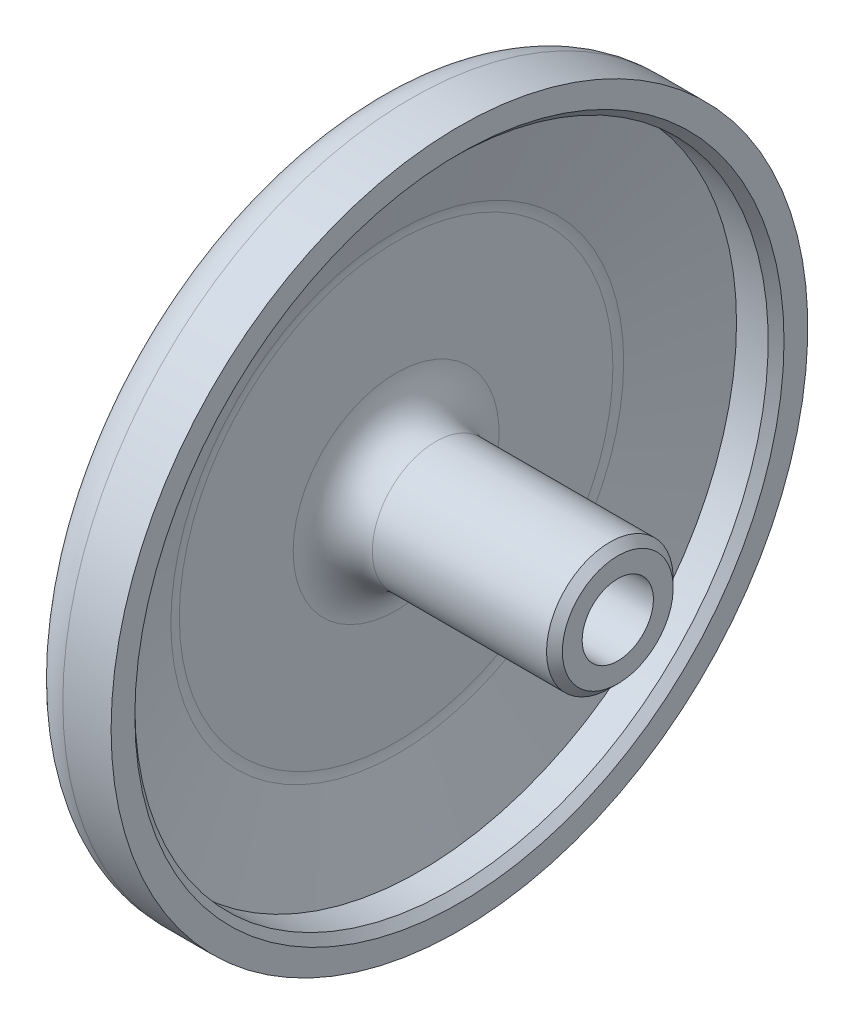
ISO-10303-21;
HEADER;
FILE_DESCRIPTION(('STEP AP214'),'2;1');
FILE_NAME('part.step','',(''),(''),'','','');
FILE_SCHEMA(('AUTOMOTIVE_DESIGN { 1 0 10303 214 1 1 1 1 }'));
ENDSEC;
DATA;
#1=APPLICATION_CONTEXT('core data for automotive mechanical design processes');
#2=APPLICATION_PROTOCOL_DEFINITION('international standard','automotive_design',2000,#1);
#3=PRODUCT_CONTEXT('',#1,'mechanical');
#4=PRODUCT('Part','Part','',(#3));
#5=PRODUCT_RELATED_PRODUCT_CATEGORY('part','',(#4));
#6=PRODUCT_DEFINITION_FORMATION('','',#4);
#7=PRODUCT_DEFINITION_CONTEXT('part definition',#1,'design');
#8=PRODUCT_DEFINITION('design','',#6,#7);
#9=PRODUCT_DEFINITION_SHAPE('','',#8);
#10=(LENGTH_UNIT() NAMED_UNIT(*) SI_UNIT(.MILLI.,.METRE.));
#11=(NAMED_UNIT(*) PLANE_ANGLE_UNIT() SI_UNIT($,.RADIAN.));
#12=(NAMED_UNIT(*) SI_UNIT($,.STERADIAN.) SOLID_ANGLE_UNIT());
#13=UNCERTAINTY_MEASURE_WITH_UNIT(LENGTH_MEASURE(1.E-05),#10,'distance_accuracy_value','');
#14=(GEOMETRIC_REPRESENTATION_CONTEXT(3) GLOBAL_UNCERTAINTY_ASSIGNED_CONTEXT((#13)) GLOBAL_UNIT_ASSIGNED_CONTEXT((#10,
#11,#12)) REPRESENTATION_CONTEXT('',''));
#15=CARTESIAN_POINT('',(0.,0.,0.));
#16=DIRECTION('',(0.,0.,1.));
#17=DIRECTION('',(1.,0.,0.));
#18=AXIS2_PLACEMENT_3D('',#15,#16,#17);
#19=CARTESIAN_POINT('',(0.,0.,0.));
#20=DIRECTION('',(-1.,0.,0.));
#21=DIRECTION('',(0.,0.,1.));
#22=AXIS2_PLACEMENT_3D('',#19,#20,#21);
#23=CYLINDRICAL_SURFACE('',#22,22.);
#24=CARTESIAN_POINT('',(0.951941016011039,0.,0.));
#25=DIRECTION('',(1.,0.,0.));
#26=DIRECTION('',(0.,0.,-1.));
#27=AXIS2_PLACEMENT_3D('',#24,#25,#26);
#28=CIRCLE('',#27,22.);
#29=CARTESIAN_POINT('',(0.951941016011039,0.,-22.));
#30=VERTEX_POINT('',#29);
#31=EDGE_CURVE('E67',#30,#30,#28,.T.);
#32=ORIENTED_EDGE('',*,*,#31,.T.);
#33=EDGE_LOOP('',(#32));
#34=FACE_BOUND('',#33,.T.);
#35=CARTESIAN_POINT('',(4.,0.,0.));
#36=DIRECTION('',(-1.,0.,0.));
#37=DIRECTION('',(0.,0.,1.));
#38=AXIS2_PLACEMENT_3D('',#35,#36,#37);
#39=CIRCLE('',#38,22.);
#40=CARTESIAN_POINT('',(4.,0.,22.));
#41=VERTEX_POINT('',#40);
#42=EDGE_CURVE('E79',#41,#41,#39,.T.);
#43=ORIENTED_EDGE('',*,*,#42,.T.);
#44=EDGE_LOOP('',(#43));
#45=FACE_BOUND('',#44,.T.);
#46=ADVANCED_FACE('F29',(#34,#45),#23,.T.);
#47=CARTESIAN_POINT('',(4.,22.,0.));
#48=DIRECTION('',(-1.,0.,0.));
#49=DIRECTION('',(0.,0.,1.));
#50=AXIS2_PLACEMENT_3D('',#47,#48,#49);
#51=PLANE('',#50);
#52=CARTESIAN_POINT('',(4.,0.,0.));
#53=DIRECTION('',(-1.,0.,0.));
#54=DIRECTION('',(0.,0.,1.));
#55=AXIS2_PLACEMENT_3D('',#52,#53,#54);
#56=CIRCLE('',#55,20.5);
#57=CARTESIAN_POINT('',(4.,0.,20.5));
#58=VERTEX_POINT('',#57);
#59=EDGE_CURVE('E52',#58,#58,#56,.T.);
#60=ORIENTED_EDGE('',*,*,#59,.T.);
#61=EDGE_LOOP('',(#60));
#62=FACE_BOUND('',#61,.T.);
#63=ORIENTED_EDGE('',*,*,#42,.F.);
#64=EDGE_LOOP('',(#63));
#65=FACE_BOUND('',#64,.T.);
#66=ADVANCED_FACE('F105',(#62,#65),#51,.F.);
#67=CARTESIAN_POINT('',(0.,0.,0.));
#68=DIRECTION('',(-1.,0.,0.));
#69=DIRECTION('',(0.,0.,1.));
#70=AXIS2_PLACEMENT_3D('',#67,#68,#69);
#71=CYLINDRICAL_SURFACE('',#70,20.);
#72=CARTESIAN_POINT('',(3.5,0.,0.));
#73=DIRECTION('',(-1.,0.,0.));
#74=DIRECTION('',(0.,0.,1.));
#75=AXIS2_PLACEMENT_3D('',#72,#73,#74);
#76=CIRCLE('',#75,20.);
#77=CARTESIAN_POINT('',(3.5,0.,20.));
#78=VERTEX_POINT('',#77);
#79=EDGE_CURVE('E49',#78,#78,#76,.F.);
#80=ORIENTED_EDGE('',*,*,#79,.T.);
#81=EDGE_LOOP('',(#80));
#82=FACE_BOUND('',#81,.T.);
#83=CARTESIAN_POINT('',(1.5,0.,0.));
#84=DIRECTION('',(-1.,0.,0.));
#85=DIRECTION('',(0.,0.,1.));
#86=AXIS2_PLACEMENT_3D('',#83,#84,#85);
#87=CIRCLE('',#86,20.);
#88=CARTESIAN_POINT('',(1.5,0.,20.));
#89=VERTEX_POINT('',#88);
#90=EDGE_CURVE('E82',#89,#89,#87,.T.);
#91=ORIENTED_EDGE('',*,*,#90,.T.);
#92=EDGE_LOOP('',(#91));
#93=FACE_BOUND('',#92,.T.);
#94=ADVANCED_FACE('F111',(#82,#93),#71,.F.);
#95=CARTESIAN_POINT('',(0.,0.,0.));
#96=DIRECTION('',(1.,0.,0.));
#97=DIRECTION('',(0.,0.,-1.));
#98=AXIS2_PLACEMENT_3D('',#95,#96,#97);
#99=CONICAL_SURFACE('',#98,14.,1.32581766366803);
#100=CARTESIAN_POINT('',(0.0746437496366645,0.,0.));
#101=DIRECTION('',(1.,0.,0.));
#102=DIRECTION('',(0.,0.,-1.));
#103=AXIS2_PLACEMENT_3D('',#100,#101,#102);
#104=CIRCLE('',#103,14.2985749985467);
#105=CARTESIAN_POINT('',(0.0746437496366645,0.,-14.2985749985467));
#106=VERTEX_POINT('',#105);
#107=EDGE_CURVE('E64',#106,#106,#104,.F.);
#108=ORIENTED_EDGE('',*,*,#107,.T.);
#109=EDGE_LOOP('',(#108));
#110=FACE_BOUND('',#109,.T.);
#111=ORIENTED_EDGE('',*,*,#90,.F.);
#112=EDGE_LOOP('',(#111));
#113=FACE_BOUND('',#112,.T.);
#114=ADVANCED_FACE('F146',(#110,#113),#99,.F.);
#115=CARTESIAN_POINT('',(0.,14.,0.));
#116=DIRECTION('',(-1.,0.,0.));
#117=DIRECTION('',(0.,0.,1.));
#118=AXIS2_PLACEMENT_3D('',#115,#116,#117);
#119=PLANE('',#118);
#120=CARTESIAN_POINT('',(0.,0.,0.));
#121=DIRECTION('',(-1.,0.,0.));
#122=DIRECTION('',(0.,0.,1.));
#123=AXIS2_PLACEMENT_3D('',#120,#121,#122);
#124=CIRCLE('',#123,13.6922359359559);
#125=CARTESIAN_POINT('',(0.,0.,13.6922359359559));
#126=VERTEX_POINT('',#125);
#127=EDGE_CURVE('E58',#126,#126,#124,.F.);
#128=ORIENTED_EDGE('',*,*,#127,.T.);
#129=EDGE_LOOP('',(#128));
#130=FACE_BOUND('',#129,.T.);
#131=CARTESIAN_POINT('',(0.,0.,0.));
#132=DIRECTION('',(-1.,0.,0.));
#133=DIRECTION('',(0.,0.,1.));
#134=AXIS2_PLACEMENT_3D('',#131,#132,#133);
#135=CIRCLE('',#134,6.5);
#136=CARTESIAN_POINT('',(0.,0.,6.5));
#137=VERTEX_POINT('',#136);
#138=EDGE_CURVE('E61',#137,#137,#135,.T.);
#139=ORIENTED_EDGE('',*,*,#138,.T.);
#140=EDGE_LOOP('',(#139));
#141=FACE_BOUND('',#140,.T.);
#142=ADVANCED_FACE('F150',(#130,#141),#119,.F.);
#143=CARTESIAN_POINT('',(0.,0.,0.));
#144=DIRECTION('',(-1.,0.,0.));
#145=DIRECTION('',(0.,0.,1.));
#146=AXIS2_PLACEMENT_3D('',#143,#144,#145);
#147=CYLINDRICAL_SURFACE('',#146,4.);
#148=CARTESIAN_POINT('',(13.5,0.,0.));
#149=DIRECTION('',(-1.,0.,0.));
#150=DIRECTION('',(0.,0.,1.));
#151=AXIS2_PLACEMENT_3D('',#148,#149,#150);
#152=CIRCLE('',#151,4.);
#153=CARTESIAN_POINT('',(13.5,0.,4.));
#154=VERTEX_POINT('',#153);
#155=EDGE_CURVE('E44',#154,#154,#152,.T.);
#156=ORIENTED_EDGE('',*,*,#155,.T.);
#157=EDGE_LOOP('',(#156));
#158=FACE_BOUND('',#157,.T.);
#159=CARTESIAN_POINT('',(2.5,0.,0.));
#160=DIRECTION('',(-1.,0.,0.));
#161=DIRECTION('',(0.,0.,1.));
#162=AXIS2_PLACEMENT_3D('',#159,#160,#161);
#163=CIRCLE('',#162,4.);
#164=CARTESIAN_POINT('',(2.5,0.,4.));
#165=VERTEX_POINT('',#164);
#166=EDGE_CURVE('E55',#165,#165,#163,.F.);
#167=ORIENTED_EDGE('',*,*,#166,.T.);
#168=EDGE_LOOP('',(#167));
#169=FACE_BOUND('',#168,.T.);
#170=ADVANCED_FACE('F156',(#158,#169),#147,.T.);
#171=CARTESIAN_POINT('',(14.,4.,0.));
#172=DIRECTION('',(-1.,0.,0.));
#173=DIRECTION('',(0.,0.,1.));
#174=AXIS2_PLACEMENT_3D('',#171,#172,#173);
#175=PLANE('',#174);
#176=CARTESIAN_POINT('',(14.,0.,0.));
#177=DIRECTION('',(-1.,0.,0.));
#178=DIRECTION('',(0.,0.,1.));
#179=AXIS2_PLACEMENT_3D('',#176,#177,#178);
#180=CIRCLE('',#179,2.25);
#181=CARTESIAN_POINT('',(14.,0.,2.25));
#182=VERTEX_POINT('',#181);
#183=EDGE_CURVE('E85',#182,#182,#180,.T.);
#184=ORIENTED_EDGE('',*,*,#183,.T.);
#185=EDGE_LOOP('',(#184));
#186=FACE_BOUND('',#185,.T.);
#187=CARTESIAN_POINT('',(14.,0.,0.));
#188=DIRECTION('',(-1.,0.,0.));
#189=DIRECTION('',(0.,0.,1.));
#190=AXIS2_PLACEMENT_3D('',#187,#188,#189);
#191=CIRCLE('',#190,3.5);
#192=CARTESIAN_POINT('',(14.,0.,3.5));
#193=VERTEX_POINT('',#192);
#194=EDGE_CURVE('E40',#193,#193,#191,.F.);
#195=ORIENTED_EDGE('',*,*,#194,.T.);
#196=EDGE_LOOP('',(#195));
#197=FACE_BOUND('',#196,.T.);
#198=ADVANCED_FACE('F89',(#186,#197),#175,.F.);
#199=CARTESIAN_POINT('',(-3.,0.,0.));
#200=DIRECTION('',(1.,0.,0.));
#201=DIRECTION('',(0.,0.,-1.));
#202=AXIS2_PLACEMENT_3D('',#199,#200,#201);
#203=PLANE('',#202);
#204=CARTESIAN_POINT('',(-3.,0.,0.));
#205=DIRECTION('',(1.,0.,0.));
#206=DIRECTION('',(0.,0.,-1.));
#207=AXIS2_PLACEMENT_3D('',#204,#205,#206);
#208=CIRCLE('',#207,3.25);
#209=CARTESIAN_POINT('',(-3.,0.,-3.25));
#210=VERTEX_POINT('',#209);
#211=EDGE_CURVE('E10',#210,#210,#208,.T.);
#212=ORIENTED_EDGE('',*,*,#211,.T.);
#213=EDGE_LOOP('',(#212));
#214=FACE_BOUND('',#213,.T.);
#215=CARTESIAN_POINT('',(-3.,0.,0.));
#216=DIRECTION('',(1.,0.,0.));
#217=DIRECTION('',(0.,0.,-1.));
#218=AXIS2_PLACEMENT_3D('',#215,#216,#217);
#219=CIRCLE('',#218,13.6922359359558);
#220=CARTESIAN_POINT('',(-3.,0.,-13.6922359359558));
#221=VERTEX_POINT('',#220);
#222=EDGE_CURVE('E76',#221,#221,#219,.F.);
#223=ORIENTED_EDGE('',*,*,#222,.T.);
#224=EDGE_LOOP('',(#223));
#225=FACE_BOUND('',#224,.T.);
#226=ADVANCED_FACE('F165',(#214,#225),#203,.F.);
#227=CARTESIAN_POINT('',(-1.,0.,0.));
#228=DIRECTION('',(1.,0.,0.));
#229=DIRECTION('',(0.,0.,-1.));
#230=AXIS2_PLACEMENT_3D('',#227,#228,#229);
#231=CONICAL_SURFACE('',#230,22.,1.32581766366803);
#232=CARTESIAN_POINT('',(-2.92535625036333,0.,0.));
#233=DIRECTION('',(-1.,0.,0.));
#234=DIRECTION('',(0.,0.,1.));
#235=AXIS2_PLACEMENT_3D('',#232,#233,#234);
#236=CIRCLE('',#235,14.2985749985467);
#237=CARTESIAN_POINT('',(-2.92535625036333,0.,14.2985749985467));
#238=VERTEX_POINT('',#237);
#239=EDGE_CURVE('E70',#238,#238,#236,.F.);
#240=ORIENTED_EDGE('',*,*,#239,.T.);
#241=EDGE_LOOP('',(#240));
#242=FACE_BOUND('',#241,.T.);
#243=CARTESIAN_POINT('',(-1.47341523435229,0.,0.));
#244=DIRECTION('',(-1.,0.,0.));
#245=DIRECTION('',(0.,0.,1.));
#246=AXIS2_PLACEMENT_3D('',#243,#244,#245);
#247=CIRCLE('',#246,20.1063390625908);
#248=CARTESIAN_POINT('',(-1.47341523435229,0.,20.1063390625908));
#249=VERTEX_POINT('',#248);
#250=EDGE_CURVE('E73',#249,#249,#247,.T.);
#251=ORIENTED_EDGE('',*,*,#250,.T.);
#252=EDGE_LOOP('',(#251));
#253=FACE_BOUND('',#252,.T.);
#254=ADVANCED_FACE('F121',(#242,#253),#231,.T.);
#255=CARTESIAN_POINT('',(-0.499999999999998,0.,0.));
#256=DIRECTION('',(1.,0.,0.));
#257=DIRECTION('',(0.,0.,-1.));
#258=AXIS2_PLACEMENT_3D('',#255,#256,#257);
#259=TOROIDAL_SURFACE('',#258,13.6922359359558,2.5);
#260=ORIENTED_EDGE('',*,*,#239,.F.);
#261=EDGE_LOOP('',(#260));
#262=FACE_BOUND('',#261,.T.);
#263=ORIENTED_EDGE('',*,*,#222,.F.);
#264=EDGE_LOOP('',(#263));
#265=FACE_BOUND('',#264,.T.);
#266=ADVANCED_FACE('F117',(#262,#265),#259,.T.);
#267=CARTESIAN_POINT('',(0.951941016011039,0.,0.));
#268=DIRECTION('',(1.,0.,0.));
#269=DIRECTION('',(0.,0.,-1.));
#270=AXIS2_PLACEMENT_3D('',#267,#268,#269);
#271=TOROIDAL_SURFACE('',#270,19.5,2.5);
#272=ORIENTED_EDGE('',*,*,#31,.F.);
#273=EDGE_LOOP('',(#272));
#274=FACE_BOUND('',#273,.T.);
#275=ORIENTED_EDGE('',*,*,#250,.F.);
#276=EDGE_LOOP('',(#275));
#277=FACE_BOUND('',#276,.T.);
#278=ADVANCED_FACE('F120',(#274,#277),#271,.T.);
#279=CARTESIAN_POINT('',(2.5,0.,0.));
#280=DIRECTION('',(-1.,0.,0.));
#281=DIRECTION('',(0.,0.,1.));
#282=AXIS2_PLACEMENT_3D('',#279,#280,#281);
#283=TOROIDAL_SURFACE('',#282,13.6922359359559,2.5);
#284=ORIENTED_EDGE('',*,*,#127,.F.);
#285=EDGE_LOOP('',(#284));
#286=FACE_BOUND('',#285,.T.);
#287=ORIENTED_EDGE('',*,*,#107,.F.);
#288=EDGE_LOOP('',(#287));
#289=FACE_BOUND('',#288,.T.);
#290=ADVANCED_FACE('F125',(#286,#289),#283,.F.);
#291=CARTESIAN_POINT('',(2.5,0.,0.));
#292=DIRECTION('',(-1.,0.,0.));
#293=DIRECTION('',(0.,0.,1.));
#294=AXIS2_PLACEMENT_3D('',#291,#292,#293);
#295=TOROIDAL_SURFACE('',#294,6.5,2.5);
#296=ORIENTED_EDGE('',*,*,#166,.F.);
#297=EDGE_LOOP('',(#296));
#298=FACE_BOUND('',#297,.T.);
#299=ORIENTED_EDGE('',*,*,#138,.F.);
#300=EDGE_LOOP('',(#299));
#301=FACE_BOUND('',#300,.T.);
#302=ADVANCED_FACE('F129',(#298,#301),#295,.F.);
#303=CARTESIAN_POINT('',(4.,0.,0.));
#304=DIRECTION('',(1.,0.,0.));
#305=DIRECTION('',(0.,0.,-1.));
#306=AXIS2_PLACEMENT_3D('',#303,#304,#305);
#307=CONICAL_SURFACE('',#306,20.5,0.785398163397445);
#308=ORIENTED_EDGE('',*,*,#79,.F.);
#309=EDGE_LOOP('',(#308));
#310=FACE_BOUND('',#309,.T.);
#311=ORIENTED_EDGE('',*,*,#59,.F.);
#312=EDGE_LOOP('',(#311));
#313=FACE_BOUND('',#312,.T.);
#314=ADVANCED_FACE('F101',(#310,#313),#307,.F.);
#315=CARTESIAN_POINT('',(13.5,0.,0.));
#316=DIRECTION('',(-1.,0.,0.));
#317=DIRECTION('',(0.,0.,1.));
#318=AXIS2_PLACEMENT_3D('',#315,#316,#317);
#319=CONICAL_SURFACE('',#318,4.,0.785398163397448);
#320=ORIENTED_EDGE('',*,*,#194,.F.);
#321=EDGE_LOOP('',(#320));
#322=FACE_BOUND('',#321,.T.);
#323=ORIENTED_EDGE('',*,*,#155,.F.);
#324=EDGE_LOOP('',(#323));
#325=FACE_BOUND('',#324,.T.);
#326=ADVANCED_FACE('F94',(#322,#325),#319,.T.);
#327=CARTESIAN_POINT('',(14.,0.,0.));
#328=DIRECTION('',(-1.,0.,0.));
#329=DIRECTION('',(0.,0.,1.));
#330=AXIS2_PLACEMENT_3D('',#327,#328,#329);
#331=CYLINDRICAL_SURFACE('',#330,2.25);
#332=CARTESIAN_POINT('',(-1.99999999999999,0.,0.));
#333=DIRECTION('',(1.,0.,0.));
#334=DIRECTION('',(0.,0.,-1.));
#335=AXIS2_PLACEMENT_3D('',#332,#333,#334);
#336=CIRCLE('',#335,2.25);
#337=CARTESIAN_POINT('',(-1.99999999999999,0.,-2.25));
#338=VERTEX_POINT('',#337);
#339=EDGE_CURVE('E36',#338,#338,#336,.F.);
#340=ORIENTED_EDGE('',*,*,#339,.T.);
#341=EDGE_LOOP('',(#340));
#342=FACE_BOUND('',#341,.T.);
#343=ORIENTED_EDGE('',*,*,#183,.F.);
#344=EDGE_LOOP('',(#343));
#345=FACE_BOUND('',#344,.T.);
#346=ADVANCED_FACE('F92',(#342,#345),#331,.F.);
#347=CARTESIAN_POINT('',(-1.99999999999999,0.,0.));
#348=DIRECTION('',(-1.,0.,0.));
#349=DIRECTION('',(0.,0.,1.));
#350=AXIS2_PLACEMENT_3D('',#347,#348,#349);
#351=CONICAL_SURFACE('',#350,2.25,0.785398163397448);
#352=ORIENTED_EDGE('',*,*,#211,.F.);
#353=EDGE_LOOP('',(#352));
#354=FACE_BOUND('',#353,.T.);
#355=ORIENTED_EDGE('',*,*,#339,.F.);
#356=EDGE_LOOP('',(#355));
#357=FACE_BOUND('',#356,.T.);
#358=ADVANCED_FACE('F31',(#354,#357),#351,.F.);
#359=CLOSED_SHELL('',(#46,#66,#94,#114,#142,#170,#198,#226,#254,#266,#278,#290,#302,#314,#326,
#346,#358));
#360=MANIFOLD_SOLID_BREP('B2',#359);
#361=ADVANCED_BREP_SHAPE_REPRESENTATION('',(#18,#360),#14);
#362=SHAPE_DEFINITION_REPRESENTATION(#9,#361);
ENDSEC;
END-ISO-10303-21;
